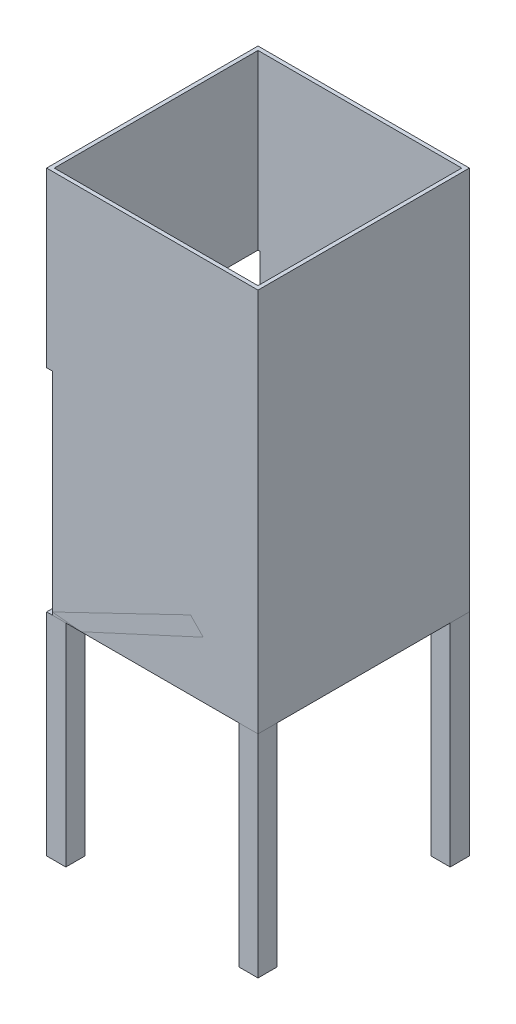
ISO-10303-21;
HEADER;
FILE_DESCRIPTION(('STEP AP214'),'2;1');
FILE_NAME('part.step','',(''),(''),'','','');
FILE_SCHEMA(('AUTOMOTIVE_DESIGN { 1 0 10303 214 1 1 1 1 }'));
ENDSEC;
DATA;
#1=APPLICATION_CONTEXT('core data for automotive mechanical design processes');
#2=APPLICATION_PROTOCOL_DEFINITION('international standard','automotive_design',2000,#1);
#3=PRODUCT_CONTEXT('',#1,'mechanical');
#4=PRODUCT('Part','Part','',(#3));
#5=PRODUCT_RELATED_PRODUCT_CATEGORY('part','',(#4));
#6=PRODUCT_DEFINITION_FORMATION('','',#4);
#7=PRODUCT_DEFINITION_CONTEXT('part definition',#1,'design');
#8=PRODUCT_DEFINITION('design','',#6,#7);
#9=PRODUCT_DEFINITION_SHAPE('','',#8);
#10=(LENGTH_UNIT() NAMED_UNIT(*) SI_UNIT(.MILLI.,.METRE.));
#11=(NAMED_UNIT(*) PLANE_ANGLE_UNIT() SI_UNIT($,.RADIAN.));
#12=(NAMED_UNIT(*) SI_UNIT($,.STERADIAN.) SOLID_ANGLE_UNIT());
#13=UNCERTAINTY_MEASURE_WITH_UNIT(LENGTH_MEASURE(1.E-05),#10,'distance_accuracy_value','');
#14=(GEOMETRIC_REPRESENTATION_CONTEXT(3) GLOBAL_UNCERTAINTY_ASSIGNED_CONTEXT((#13)) GLOBAL_UNIT_ASSIGNED_CONTEXT((#10,
#11,#12)) REPRESENTATION_CONTEXT('',''));
#15=CARTESIAN_POINT('',(0.,0.,0.));
#16=DIRECTION('',(0.,0.,1.));
#17=DIRECTION('',(1.,0.,0.));
#18=AXIS2_PLACEMENT_3D('',#15,#16,#17);
#19=CARTESIAN_POINT('',(-37.0808239238708,0.,-55.));
#20=DIRECTION('',(0.,-1.,0.));
#21=DIRECTION('',(0.,0.,-1.));
#22=AXIS2_PLACEMENT_3D('',#19,#20,#21);
#23=PLANE('',#22);
#24=DIRECTION('',(0.,0.,1.));
#25=VECTOR('',#24,1.);
#26=CARTESIAN_POINT('',(-52.,0.,-55.));
#27=LINE('',#26,#25);
#28=CARTESIAN_POINT('',(-52.,0.,-55.));
#29=VERTEX_POINT('',#28);
#30=CARTESIAN_POINT('',(-52.,0.,55.));
#31=VERTEX_POINT('',#30);
#32=EDGE_CURVE('E66',#29,#31,#27,.T.);
#33=ORIENTED_EDGE('',*,*,#32,.F.);
#34=DIRECTION('',(1.,0.,0.));
#35=VECTOR('',#34,1.);
#36=CARTESIAN_POINT('',(-37.0808239238708,0.,-55.));
#37=LINE('',#36,#35);
#38=CARTESIAN_POINT('',(-37.0808239238708,0.,-55.));
#39=VERTEX_POINT('',#38);
#40=EDGE_CURVE('E106',#29,#39,#37,.T.);
#41=ORIENTED_EDGE('',*,*,#40,.T.);
#42=DIRECTION('',(0.,0.,1.));
#43=VECTOR('',#42,1.);
#44=CARTESIAN_POINT('',(-37.0808239238708,0.,-55.));
#45=LINE('',#44,#43);
#46=CARTESIAN_POINT('',(-37.0808239238708,0.,55.));
#47=VERTEX_POINT('',#46);
#48=EDGE_CURVE('E53',#39,#47,#45,.T.);
#49=ORIENTED_EDGE('',*,*,#48,.T.);
#50=DIRECTION('',(1.,0.,0.));
#51=VECTOR('',#50,1.);
#52=CARTESIAN_POINT('',(-37.0808239238708,0.,55.));
#53=LINE('',#52,#51);
#54=EDGE_CURVE('E108',#31,#47,#53,.T.);
#55=ORIENTED_EDGE('',*,*,#54,.F.);
#56=EDGE_LOOP('',(#33,#41,#49,#55));
#57=FACE_BOUND('',#56,.T.);
#58=ADVANCED_FACE('F50',(#57),#23,.T.);
#59=CARTESIAN_POINT('',(-55.,0.,-55.));
#60=DIRECTION('',(-0.433942029879705,0.900940794227835,0.));
#61=DIRECTION('',(-0.900940794227835,-0.433942029879705,0.));
#62=AXIS2_PLACEMENT_3D('',#59,#60,#61);
#63=PLANE('',#62);
#64=DIRECTION('',(0.,0.,-1.));
#65=VECTOR('',#64,1.);
#66=CARTESIAN_POINT('',(-52.,1.44496297423724,-55.));
#67=LINE('',#66,#65);
#68=CARTESIAN_POINT('',(-52.,1.44496297423724,55.));
#69=VERTEX_POINT('',#68);
#70=CARTESIAN_POINT('',(-52.,1.44496297423724,-55.));
#71=VERTEX_POINT('',#70);
#72=EDGE_CURVE('E98',#69,#71,#67,.T.);
#73=ORIENTED_EDGE('',*,*,#72,.F.);
#74=DIRECTION('',(-0.900940794227835,-0.433942029879705,0.));
#75=VECTOR('',#74,1.);
#76=CARTESIAN_POINT('',(-55.,0.,55.));
#77=LINE('',#76,#75);
#78=CARTESIAN_POINT('',(55.,52.9819757220322,55.));
#79=VERTEX_POINT('',#78);
#80=EDGE_CURVE('E116',#79,#69,#77,.T.);
#81=ORIENTED_EDGE('',*,*,#80,.F.);
#82=DIRECTION('',(0.,0.,1.));
#83=VECTOR('',#82,1.);
#84=CARTESIAN_POINT('',(55.,52.9819757220322,-55.));
#85=LINE('',#84,#83);
#86=CARTESIAN_POINT('',(55.,52.9819757220322,-55.));
#87=VERTEX_POINT('',#86);
#88=EDGE_CURVE('E12',#87,#79,#85,.T.);
#89=ORIENTED_EDGE('',*,*,#88,.F.);
#90=DIRECTION('',(-0.900940794227835,-0.433942029879705,0.));
#91=VECTOR('',#90,1.);
#92=CARTESIAN_POINT('',(-55.,0.,-55.));
#93=LINE('',#92,#91);
#94=EDGE_CURVE('E126',#87,#71,#93,.T.);
#95=ORIENTED_EDGE('',*,*,#94,.T.);
#96=EDGE_LOOP('',(#73,#81,#89,#95));
#97=FACE_BOUND('',#96,.T.);
#98=ADVANCED_FACE('F139',(#97),#63,.T.);
#99=CARTESIAN_POINT('',(55.,52.9819757220322,-55.));
#100=DIRECTION('',(1.,0.,0.));
#101=DIRECTION('',(0.,0.,-1.));
#102=AXIS2_PLACEMENT_3D('',#99,#100,#101);
#103=PLANE('',#102);
#104=ORIENTED_EDGE('',*,*,#88,.T.);
#105=DIRECTION('',(0.,1.,0.));
#106=VECTOR('',#105,1.);
#107=CARTESIAN_POINT('',(55.,52.9819757220322,55.));
#108=LINE('',#107,#106);
#109=CARTESIAN_POINT('',(55.,42.4740583158127,55.));
#110=VERTEX_POINT('',#109);
#111=EDGE_CURVE('E121',#110,#79,#108,.T.);
#112=ORIENTED_EDGE('',*,*,#111,.F.);
#113=DIRECTION('',(0.,0.,1.));
#114=VECTOR('',#113,1.);
#115=CARTESIAN_POINT('',(55.,42.4740583158127,-55.));
#116=LINE('',#115,#114);
#117=CARTESIAN_POINT('',(55.,42.4740583158127,-55.));
#118=VERTEX_POINT('',#117);
#119=EDGE_CURVE('E58',#118,#110,#116,.T.);
#120=ORIENTED_EDGE('',*,*,#119,.F.);
#121=DIRECTION('',(0.,1.,0.));
#122=VECTOR('',#121,1.);
#123=CARTESIAN_POINT('',(55.,52.9819757220322,-55.));
#124=LINE('',#123,#122);
#125=EDGE_CURVE('E118',#118,#87,#124,.T.);
#126=ORIENTED_EDGE('',*,*,#125,.T.);
#127=EDGE_LOOP('',(#104,#112,#120,#126));
#128=FACE_BOUND('',#127,.T.);
#129=ADVANCED_FACE('F142',(#128),#103,.T.);
#130=CARTESIAN_POINT('',(55.,42.4740583158127,-55.));
#131=DIRECTION('',(0.418856684755655,-0.908052354016828,0.));
#132=DIRECTION('',(0.908052354016828,0.418856684755655,0.));
#133=AXIS2_PLACEMENT_3D('',#130,#131,#132);
#134=PLANE('',#133);
#135=ORIENTED_EDGE('',*,*,#119,.T.);
#136=DIRECTION('',(0.908052354016828,0.418856684755655,0.));
#137=VECTOR('',#136,1.);
#138=CARTESIAN_POINT('',(55.,42.4740583158127,55.));
#139=LINE('',#138,#137);
#140=EDGE_CURVE('E130',#47,#110,#139,.T.);
#141=ORIENTED_EDGE('',*,*,#140,.F.);
#142=ORIENTED_EDGE('',*,*,#48,.F.);
#143=DIRECTION('',(0.908052354016828,0.418856684755655,0.));
#144=VECTOR('',#143,1.);
#145=CARTESIAN_POINT('',(55.,42.4740583158127,-55.));
#146=LINE('',#145,#144);
#147=EDGE_CURVE('E115',#39,#118,#146,.T.);
#148=ORIENTED_EDGE('',*,*,#147,.T.);
#149=EDGE_LOOP('',(#135,#141,#142,#148));
#150=FACE_BOUND('',#149,.T.);
#151=ADVANCED_FACE('F131',(#150),#134,.T.);
#152=CARTESIAN_POINT('',(0.,0.,-55.));
#153=DIRECTION('',(0.,0.,1.));
#154=DIRECTION('',(1.,0.,0.));
#155=AXIS2_PLACEMENT_3D('',#152,#153,#154);
#156=PLANE('',#155);
#157=ORIENTED_EDGE('',*,*,#40,.F.);
#158=DIRECTION('',(0.,-1.,0.));
#159=VECTOR('',#158,1.);
#160=CARTESIAN_POINT('',(-52.,0.,-55.));
#161=LINE('',#160,#159);
#162=EDGE_CURVE('E95',#71,#29,#161,.T.);
#163=ORIENTED_EDGE('',*,*,#162,.F.);
#164=ORIENTED_EDGE('',*,*,#94,.F.);
#165=ORIENTED_EDGE('',*,*,#125,.F.);
#166=ORIENTED_EDGE('',*,*,#147,.F.);
#167=EDGE_LOOP('',(#157,#163,#164,#165,#166));
#168=FACE_BOUND('',#167,.T.);
#169=ADVANCED_FACE('F112',(#168),#156,.F.);
#170=CARTESIAN_POINT('',(0.,0.,55.));
#171=DIRECTION('',(0.,0.,1.));
#172=DIRECTION('',(1.,0.,0.));
#173=AXIS2_PLACEMENT_3D('',#170,#171,#172);
#174=PLANE('',#173);
#175=DIRECTION('',(0.,1.,0.));
#176=VECTOR('',#175,1.);
#177=CARTESIAN_POINT('',(-52.,0.,55.));
#178=LINE('',#177,#176);
#179=EDGE_CURVE('E109',#31,#69,#178,.T.);
#180=ORIENTED_EDGE('',*,*,#179,.F.);
#181=ORIENTED_EDGE('',*,*,#54,.T.);
#182=ORIENTED_EDGE('',*,*,#140,.T.);
#183=ORIENTED_EDGE('',*,*,#111,.T.);
#184=ORIENTED_EDGE('',*,*,#80,.T.);
#185=EDGE_LOOP('',(#180,#181,#182,#183,#184));
#186=FACE_BOUND('',#185,.T.);
#187=ADVANCED_FACE('F140',(#186),#174,.T.);
#188=CARTESIAN_POINT('',(-52.,0.,0.));
#189=DIRECTION('',(1.,0.,0.));
#190=DIRECTION('',(0.,0.,-1.));
#191=AXIS2_PLACEMENT_3D('',#188,#189,#190);
#192=PLANE('',#191);
#193=ORIENTED_EDGE('',*,*,#72,.T.);
#194=ORIENTED_EDGE('',*,*,#162,.T.);
#195=ORIENTED_EDGE('',*,*,#32,.T.);
#196=ORIENTED_EDGE('',*,*,#179,.T.);
#197=EDGE_LOOP('',(#193,#194,#195,#196));
#198=FACE_BOUND('',#197,.T.);
#199=ADVANCED_FACE('F96',(#198),#192,.F.);
#200=CLOSED_SHELL('',(#58,#98,#129,#151,#169,#187,#199));
#201=MANIFOLD_SOLID_BREP('B2',#200);
#202=CARTESIAN_POINT('',(-55.,-110.,-55.));
#203=DIRECTION('',(-1.,0.,0.));
#204=DIRECTION('',(0.,0.,1.));
#205=AXIS2_PLACEMENT_3D('',#202,#203,#204);
#206=PLANE('',#205);
#207=DIRECTION('',(0.,0.,1.));
#208=VECTOR('',#207,1.);
#209=CARTESIAN_POINT('',(-55.,0.,-55.));
#210=LINE('',#209,#208);
#211=CARTESIAN_POINT('',(-55.,0.,-55.));
#212=VERTEX_POINT('',#211);
#213=CARTESIAN_POINT('',(-55.,0.,-45.));
#214=VERTEX_POINT('',#213);
#215=EDGE_CURVE('E276',#212,#214,#210,.T.);
#216=ORIENTED_EDGE('',*,*,#215,.F.);
#217=DIRECTION('',(0.,1.,0.));
#218=VECTOR('',#217,1.);
#219=CARTESIAN_POINT('',(-55.,-110.,-55.));
#220=LINE('',#219,#218);
#221=CARTESIAN_POINT('',(-55.,-110.,-55.));
#222=VERTEX_POINT('',#221);
#223=EDGE_CURVE('E48',#222,#212,#220,.T.);
#224=ORIENTED_EDGE('',*,*,#223,.F.);
#225=DIRECTION('',(0.,0.,1.));
#226=VECTOR('',#225,1.);
#227=CARTESIAN_POINT('',(-55.,-110.,-55.));
#228=LINE('',#227,#226);
#229=CARTESIAN_POINT('',(-55.,-110.,-45.));
#230=VERTEX_POINT('',#229);
#231=EDGE_CURVE('E271',#222,#230,#228,.T.);
#232=ORIENTED_EDGE('',*,*,#231,.T.);
#233=DIRECTION('',(0.,1.,0.));
#234=VECTOR('',#233,1.);
#235=CARTESIAN_POINT('',(-55.,-110.,-45.));
#236=LINE('',#235,#234);
#237=EDGE_CURVE('E213',#230,#214,#236,.T.);
#238=ORIENTED_EDGE('',*,*,#237,.T.);
#239=EDGE_LOOP('',(#216,#224,#232,#238));
#240=FACE_BOUND('',#239,.T.);
#241=ADVANCED_FACE('F210',(#240),#206,.T.);
#242=CARTESIAN_POINT('',(-55.,-110.,-55.));
#243=DIRECTION('',(0.,0.,-1.));
#244=DIRECTION('',(-1.,0.,0.));
#245=AXIS2_PLACEMENT_3D('',#242,#243,#244);
#246=PLANE('',#245);
#247=DIRECTION('',(-1.,0.,0.));
#248=VECTOR('',#247,1.);
#249=CARTESIAN_POINT('',(-55.,0.,-55.));
#250=LINE('',#249,#248);
#251=CARTESIAN_POINT('',(-45.,0.,-55.));
#252=VERTEX_POINT('',#251);
#253=EDGE_CURVE('E249',#252,#212,#250,.T.);
#254=ORIENTED_EDGE('',*,*,#253,.F.);
#255=DIRECTION('',(0.,1.,0.));
#256=VECTOR('',#255,1.);
#257=CARTESIAN_POINT('',(-45.,-110.,-55.));
#258=LINE('',#257,#256);
#259=CARTESIAN_POINT('',(-45.,-110.,-55.));
#260=VERTEX_POINT('',#259);
#261=EDGE_CURVE('E219',#260,#252,#258,.T.);
#262=ORIENTED_EDGE('',*,*,#261,.F.);
#263=DIRECTION('',(-1.,0.,0.));
#264=VECTOR('',#263,1.);
#265=CARTESIAN_POINT('',(-55.,-110.,-55.));
#266=LINE('',#265,#264);
#267=EDGE_CURVE('E268',#260,#222,#266,.T.);
#268=ORIENTED_EDGE('',*,*,#267,.T.);
#269=ORIENTED_EDGE('',*,*,#223,.T.);
#270=EDGE_LOOP('',(#254,#262,#268,#269));
#271=FACE_BOUND('',#270,.T.);
#272=ADVANCED_FACE('F284',(#271),#246,.T.);
#273=CARTESIAN_POINT('',(-45.,-110.,-55.));
#274=DIRECTION('',(1.,0.,0.));
#275=DIRECTION('',(0.,0.,-1.));
#276=AXIS2_PLACEMENT_3D('',#273,#274,#275);
#277=PLANE('',#276);
#278=DIRECTION('',(0.,0.,-1.));
#279=VECTOR('',#278,1.);
#280=CARTESIAN_POINT('',(-45.,0.,-55.));
#281=LINE('',#280,#279);
#282=CARTESIAN_POINT('',(-45.,0.,-45.));
#283=VERTEX_POINT('',#282);
#284=EDGE_CURVE('E263',#283,#252,#281,.T.);
#285=ORIENTED_EDGE('',*,*,#284,.F.);
#286=DIRECTION('',(0.,1.,0.));
#287=VECTOR('',#286,1.);
#288=CARTESIAN_POINT('',(-45.,-110.,-45.));
#289=LINE('',#288,#287);
#290=CARTESIAN_POINT('',(-45.,-110.,-45.));
#291=VERTEX_POINT('',#290);
#292=EDGE_CURVE('E258',#291,#283,#289,.T.);
#293=ORIENTED_EDGE('',*,*,#292,.F.);
#294=DIRECTION('',(0.,0.,-1.));
#295=VECTOR('',#294,1.);
#296=CARTESIAN_POINT('',(-45.,-110.,-55.));
#297=LINE('',#296,#295);
#298=EDGE_CURVE('E261',#291,#260,#297,.T.);
#299=ORIENTED_EDGE('',*,*,#298,.T.);
#300=ORIENTED_EDGE('',*,*,#261,.T.);
#301=EDGE_LOOP('',(#285,#293,#299,#300));
#302=FACE_BOUND('',#301,.T.);
#303=ADVANCED_FACE('F260',(#302),#277,.T.);
#304=CARTESIAN_POINT('',(-55.,-110.,-45.));
#305=DIRECTION('',(0.,0.,1.));
#306=DIRECTION('',(1.,0.,0.));
#307=AXIS2_PLACEMENT_3D('',#304,#305,#306);
#308=PLANE('',#307);
#309=DIRECTION('',(1.,0.,0.));
#310=VECTOR('',#309,1.);
#311=CARTESIAN_POINT('',(-55.,0.,-45.));
#312=LINE('',#311,#310);
#313=EDGE_CURVE('E278',#214,#283,#312,.T.);
#314=ORIENTED_EDGE('',*,*,#313,.F.);
#315=ORIENTED_EDGE('',*,*,#237,.F.);
#316=DIRECTION('',(1.,0.,0.));
#317=VECTOR('',#316,1.);
#318=CARTESIAN_POINT('',(-55.,-110.,-45.));
#319=LINE('',#318,#317);
#320=EDGE_CURVE('E266',#230,#291,#319,.T.);
#321=ORIENTED_EDGE('',*,*,#320,.T.);
#322=ORIENTED_EDGE('',*,*,#292,.T.);
#323=EDGE_LOOP('',(#314,#315,#321,#322));
#324=FACE_BOUND('',#323,.T.);
#325=ADVANCED_FACE('F270',(#324),#308,.T.);
#326=CARTESIAN_POINT('',(0.,-110.,0.));
#327=DIRECTION('',(0.,1.,0.));
#328=DIRECTION('',(0.,0.,1.));
#329=AXIS2_PLACEMENT_3D('',#326,#327,#328);
#330=PLANE('',#329);
#331=ORIENTED_EDGE('',*,*,#231,.F.);
#332=ORIENTED_EDGE('',*,*,#267,.F.);
#333=ORIENTED_EDGE('',*,*,#298,.F.);
#334=ORIENTED_EDGE('',*,*,#320,.F.);
#335=EDGE_LOOP('',(#331,#332,#333,#334));
#336=FACE_BOUND('',#335,.T.);
#337=ADVANCED_FACE('F265',(#336),#330,.F.);
#338=CARTESIAN_POINT('',(0.,0.,0.));
#339=DIRECTION('',(0.,1.,0.));
#340=DIRECTION('',(0.,0.,1.));
#341=AXIS2_PLACEMENT_3D('',#338,#339,#340);
#342=PLANE('',#341);
#343=ORIENTED_EDGE('',*,*,#313,.T.);
#344=ORIENTED_EDGE('',*,*,#284,.T.);
#345=ORIENTED_EDGE('',*,*,#253,.T.);
#346=ORIENTED_EDGE('',*,*,#215,.T.);
#347=EDGE_LOOP('',(#343,#344,#345,#346));
#348=FACE_BOUND('',#347,.T.);
#349=ADVANCED_FACE('F282',(#348),#342,.T.);
#350=CLOSED_SHELL('',(#241,#272,#303,#325,#337,#349));
#351=MANIFOLD_SOLID_BREP('B6',#350);
#352=CARTESIAN_POINT('',(-55.,-110.,55.));
#353=DIRECTION('',(-1.,0.,0.));
#354=DIRECTION('',(0.,0.,1.));
#355=AXIS2_PLACEMENT_3D('',#352,#353,#354);
#356=PLANE('',#355);
#357=DIRECTION('',(0.,0.,1.));
#358=VECTOR('',#357,1.);
#359=CARTESIAN_POINT('',(-55.,0.,55.));
#360=LINE('',#359,#358);
#361=CARTESIAN_POINT('',(-55.,0.,45.));
#362=VERTEX_POINT('',#361);
#363=CARTESIAN_POINT('',(-55.,0.,55.));
#364=VERTEX_POINT('',#363);
#365=EDGE_CURVE('E404',#362,#364,#360,.T.);
#366=ORIENTED_EDGE('',*,*,#365,.F.);
#367=DIRECTION('',(0.,1.,0.));
#368=VECTOR('',#367,1.);
#369=CARTESIAN_POINT('',(-55.,-110.,45.));
#370=LINE('',#369,#368);
#371=CARTESIAN_POINT('',(-55.,-110.,45.));
#372=VERTEX_POINT('',#371);
#373=EDGE_CURVE('E208',#372,#362,#370,.T.);
#374=ORIENTED_EDGE('',*,*,#373,.F.);
#375=DIRECTION('',(0.,0.,1.));
#376=VECTOR('',#375,1.);
#377=CARTESIAN_POINT('',(-55.,-110.,55.));
#378=LINE('',#377,#376);
#379=CARTESIAN_POINT('',(-55.,-110.,55.));
#380=VERTEX_POINT('',#379);
#381=EDGE_CURVE('E399',#372,#380,#378,.T.);
#382=ORIENTED_EDGE('',*,*,#381,.T.);
#383=DIRECTION('',(0.,1.,0.));
#384=VECTOR('',#383,1.);
#385=CARTESIAN_POINT('',(-55.,-110.,55.));
#386=LINE('',#385,#384);
#387=EDGE_CURVE('E341',#380,#364,#386,.T.);
#388=ORIENTED_EDGE('',*,*,#387,.T.);
#389=EDGE_LOOP('',(#366,#374,#382,#388));
#390=FACE_BOUND('',#389,.T.);
#391=ADVANCED_FACE('F338',(#390),#356,.T.);
#392=CARTESIAN_POINT('',(-55.,-110.,45.));
#393=DIRECTION('',(0.,0.,-1.));
#394=DIRECTION('',(-1.,0.,0.));
#395=AXIS2_PLACEMENT_3D('',#392,#393,#394);
#396=PLANE('',#395);
#397=DIRECTION('',(-1.,0.,0.));
#398=VECTOR('',#397,1.);
#399=CARTESIAN_POINT('',(-55.,0.,45.));
#400=LINE('',#399,#398);
#401=CARTESIAN_POINT('',(-45.,0.,45.));
#402=VERTEX_POINT('',#401);
#403=EDGE_CURVE('E377',#402,#362,#400,.T.);
#404=ORIENTED_EDGE('',*,*,#403,.F.);
#405=DIRECTION('',(0.,1.,0.));
#406=VECTOR('',#405,1.);
#407=CARTESIAN_POINT('',(-45.,-110.,45.));
#408=LINE('',#407,#406);
#409=CARTESIAN_POINT('',(-45.,-110.,45.));
#410=VERTEX_POINT('',#409);
#411=EDGE_CURVE('E347',#410,#402,#408,.T.);
#412=ORIENTED_EDGE('',*,*,#411,.F.);
#413=DIRECTION('',(-1.,0.,0.));
#414=VECTOR('',#413,1.);
#415=CARTESIAN_POINT('',(-55.,-110.,45.));
#416=LINE('',#415,#414);
#417=EDGE_CURVE('E396',#410,#372,#416,.T.);
#418=ORIENTED_EDGE('',*,*,#417,.T.);
#419=ORIENTED_EDGE('',*,*,#373,.T.);
#420=EDGE_LOOP('',(#404,#412,#418,#419));
#421=FACE_BOUND('',#420,.T.);
#422=ADVANCED_FACE('F412',(#421),#396,.T.);
#423=CARTESIAN_POINT('',(-45.,-110.,55.));
#424=DIRECTION('',(1.,0.,0.));
#425=DIRECTION('',(0.,0.,-1.));
#426=AXIS2_PLACEMENT_3D('',#423,#424,#425);
#427=PLANE('',#426);
#428=DIRECTION('',(0.,0.,-1.));
#429=VECTOR('',#428,1.);
#430=CARTESIAN_POINT('',(-45.,0.,55.));
#431=LINE('',#430,#429);
#432=CARTESIAN_POINT('',(-45.,0.,55.));
#433=VERTEX_POINT('',#432);
#434=EDGE_CURVE('E391',#433,#402,#431,.T.);
#435=ORIENTED_EDGE('',*,*,#434,.F.);
#436=DIRECTION('',(0.,1.,0.));
#437=VECTOR('',#436,1.);
#438=CARTESIAN_POINT('',(-45.,-110.,55.));
#439=LINE('',#438,#437);
#440=CARTESIAN_POINT('',(-45.,-110.,55.));
#441=VERTEX_POINT('',#440);
#442=EDGE_CURVE('E386',#441,#433,#439,.T.);
#443=ORIENTED_EDGE('',*,*,#442,.F.);
#444=DIRECTION('',(0.,0.,-1.));
#445=VECTOR('',#444,1.);
#446=CARTESIAN_POINT('',(-45.,-110.,55.));
#447=LINE('',#446,#445);
#448=EDGE_CURVE('E389',#441,#410,#447,.T.);
#449=ORIENTED_EDGE('',*,*,#448,.T.);
#450=ORIENTED_EDGE('',*,*,#411,.T.);
#451=EDGE_LOOP('',(#435,#443,#449,#450));
#452=FACE_BOUND('',#451,.T.);
#453=ADVANCED_FACE('F388',(#452),#427,.T.);
#454=CARTESIAN_POINT('',(-55.,-110.,55.));
#455=DIRECTION('',(0.,0.,1.));
#456=DIRECTION('',(1.,0.,0.));
#457=AXIS2_PLACEMENT_3D('',#454,#455,#456);
#458=PLANE('',#457);
#459=DIRECTION('',(1.,0.,0.));
#460=VECTOR('',#459,1.);
#461=CARTESIAN_POINT('',(-55.,0.,55.));
#462=LINE('',#461,#460);
#463=EDGE_CURVE('E406',#364,#433,#462,.T.);
#464=ORIENTED_EDGE('',*,*,#463,.F.);
#465=ORIENTED_EDGE('',*,*,#387,.F.);
#466=DIRECTION('',(1.,0.,0.));
#467=VECTOR('',#466,1.);
#468=CARTESIAN_POINT('',(-55.,-110.,55.));
#469=LINE('',#468,#467);
#470=EDGE_CURVE('E394',#380,#441,#469,.T.);
#471=ORIENTED_EDGE('',*,*,#470,.T.);
#472=ORIENTED_EDGE('',*,*,#442,.T.);
#473=EDGE_LOOP('',(#464,#465,#471,#472));
#474=FACE_BOUND('',#473,.T.);
#475=ADVANCED_FACE('F398',(#474),#458,.T.);
#476=CARTESIAN_POINT('',(0.,-110.,0.));
#477=DIRECTION('',(0.,-1.,0.));
#478=DIRECTION('',(0.,0.,-1.));
#479=AXIS2_PLACEMENT_3D('',#476,#477,#478);
#480=PLANE('',#479);
#481=ORIENTED_EDGE('',*,*,#381,.F.);
#482=ORIENTED_EDGE('',*,*,#417,.F.);
#483=ORIENTED_EDGE('',*,*,#448,.F.);
#484=ORIENTED_EDGE('',*,*,#470,.F.);
#485=EDGE_LOOP('',(#481,#482,#483,#484));
#486=FACE_BOUND('',#485,.T.);
#487=ADVANCED_FACE('F393',(#486),#480,.T.);
#488=CARTESIAN_POINT('',(0.,0.,0.));
#489=DIRECTION('',(0.,-1.,0.));
#490=DIRECTION('',(0.,0.,-1.));
#491=AXIS2_PLACEMENT_3D('',#488,#489,#490);
#492=PLANE('',#491);
#493=ORIENTED_EDGE('',*,*,#403,.T.);
#494=ORIENTED_EDGE('',*,*,#365,.T.);
#495=ORIENTED_EDGE('',*,*,#463,.T.);
#496=ORIENTED_EDGE('',*,*,#434,.T.);
#497=EDGE_LOOP('',(#493,#494,#495,#496));
#498=FACE_BOUND('',#497,.T.);
#499=ADVANCED_FACE('F410',(#498),#492,.F.);
#500=CLOSED_SHELL('',(#391,#422,#453,#475,#487,#499));
#501=MANIFOLD_SOLID_BREP('B42',#500);
#502=CARTESIAN_POINT('',(55.,-110.,-55.));
#503=DIRECTION('',(1.,0.,0.));
#504=DIRECTION('',(0.,0.,-1.));
#505=AXIS2_PLACEMENT_3D('',#502,#503,#504);
#506=PLANE('',#505);
#507=DIRECTION('',(0.,0.,-1.));
#508=VECTOR('',#507,1.);
#509=CARTESIAN_POINT('',(55.,0.,-55.));
#510=LINE('',#509,#508);
#511=CARTESIAN_POINT('',(55.,0.,-45.));
#512=VERTEX_POINT('',#511);
#513=CARTESIAN_POINT('',(55.,0.,-55.));
#514=VERTEX_POINT('',#513);
#515=EDGE_CURVE('E530',#512,#514,#510,.T.);
#516=ORIENTED_EDGE('',*,*,#515,.F.);
#517=DIRECTION('',(0.,1.,0.));
#518=VECTOR('',#517,1.);
#519=CARTESIAN_POINT('',(55.,-110.,-45.));
#520=LINE('',#519,#518);
#521=CARTESIAN_POINT('',(55.,-110.,-45.));
#522=VERTEX_POINT('',#521);
#523=EDGE_CURVE('E336',#522,#512,#520,.T.);
#524=ORIENTED_EDGE('',*,*,#523,.F.);
#525=DIRECTION('',(0.,0.,-1.));
#526=VECTOR('',#525,1.);
#527=CARTESIAN_POINT('',(55.,-110.,-55.));
#528=LINE('',#527,#526);
#529=CARTESIAN_POINT('',(55.,-110.,-55.));
#530=VERTEX_POINT('',#529);
#531=EDGE_CURVE('E524',#522,#530,#528,.T.);
#532=ORIENTED_EDGE('',*,*,#531,.T.);
#533=DIRECTION('',(0.,1.,0.));
#534=VECTOR('',#533,1.);
#535=CARTESIAN_POINT('',(55.,-110.,-55.));
#536=LINE('',#535,#534);
#537=EDGE_CURVE('E469',#530,#514,#536,.T.);
#538=ORIENTED_EDGE('',*,*,#537,.T.);
#539=EDGE_LOOP('',(#516,#524,#532,#538));
#540=FACE_BOUND('',#539,.T.);
#541=ADVANCED_FACE('F466',(#540),#506,.T.);
#542=CARTESIAN_POINT('',(55.,-110.,-45.));
#543=DIRECTION('',(0.,0.,1.));
#544=DIRECTION('',(1.,0.,0.));
#545=AXIS2_PLACEMENT_3D('',#542,#543,#544);
#546=PLANE('',#545);
#547=DIRECTION('',(1.,0.,0.));
#548=VECTOR('',#547,1.);
#549=CARTESIAN_POINT('',(55.,0.,-45.));
#550=LINE('',#549,#548);
#551=CARTESIAN_POINT('',(45.,0.,-45.));
#552=VERTEX_POINT('',#551);
#553=EDGE_CURVE('E526',#552,#512,#550,.T.);
#554=ORIENTED_EDGE('',*,*,#553,.F.);
#555=DIRECTION('',(0.,1.,0.));
#556=VECTOR('',#555,1.);
#557=CARTESIAN_POINT('',(45.,-110.,-45.));
#558=LINE('',#557,#556);
#559=CARTESIAN_POINT('',(45.,-110.,-45.));
#560=VERTEX_POINT('',#559);
#561=EDGE_CURVE('E475',#560,#552,#558,.T.);
#562=ORIENTED_EDGE('',*,*,#561,.F.);
#563=DIRECTION('',(1.,0.,0.));
#564=VECTOR('',#563,1.);
#565=CARTESIAN_POINT('',(55.,-110.,-45.));
#566=LINE('',#565,#564);
#567=EDGE_CURVE('E521',#560,#522,#566,.T.);
#568=ORIENTED_EDGE('',*,*,#567,.T.);
#569=ORIENTED_EDGE('',*,*,#523,.T.);
#570=EDGE_LOOP('',(#554,#562,#568,#569));
#571=FACE_BOUND('',#570,.T.);
#572=ADVANCED_FACE('F540',(#571),#546,.T.);
#573=CARTESIAN_POINT('',(45.,-110.,-55.));
#574=DIRECTION('',(-1.,0.,0.));
#575=DIRECTION('',(0.,0.,1.));
#576=AXIS2_PLACEMENT_3D('',#573,#574,#575);
#577=PLANE('',#576);
#578=DIRECTION('',(0.,0.,1.));
#579=VECTOR('',#578,1.);
#580=CARTESIAN_POINT('',(45.,0.,-55.));
#581=LINE('',#580,#579);
#582=CARTESIAN_POINT('',(45.,0.,-55.));
#583=VERTEX_POINT('',#582);
#584=EDGE_CURVE('E516',#583,#552,#581,.T.);
#585=ORIENTED_EDGE('',*,*,#584,.F.);
#586=DIRECTION('',(0.,1.,0.));
#587=VECTOR('',#586,1.);
#588=CARTESIAN_POINT('',(45.,-110.,-55.));
#589=LINE('',#588,#587);
#590=CARTESIAN_POINT('',(45.,-110.,-55.));
#591=VERTEX_POINT('',#590);
#592=EDGE_CURVE('E511',#591,#583,#589,.T.);
#593=ORIENTED_EDGE('',*,*,#592,.F.);
#594=DIRECTION('',(0.,0.,1.));
#595=VECTOR('',#594,1.);
#596=CARTESIAN_POINT('',(45.,-110.,-55.));
#597=LINE('',#596,#595);
#598=EDGE_CURVE('E514',#591,#560,#597,.T.);
#599=ORIENTED_EDGE('',*,*,#598,.T.);
#600=ORIENTED_EDGE('',*,*,#561,.T.);
#601=EDGE_LOOP('',(#585,#593,#599,#600));
#602=FACE_BOUND('',#601,.T.);
#603=ADVANCED_FACE('F513',(#602),#577,.T.);
#604=CARTESIAN_POINT('',(55.,-110.,-55.));
#605=DIRECTION('',(0.,0.,-1.));
#606=DIRECTION('',(-1.,0.,0.));
#607=AXIS2_PLACEMENT_3D('',#604,#605,#606);
#608=PLANE('',#607);
#609=DIRECTION('',(-1.,0.,0.));
#610=VECTOR('',#609,1.);
#611=CARTESIAN_POINT('',(55.,0.,-55.));
#612=LINE('',#611,#610);
#613=EDGE_CURVE('E533',#514,#583,#612,.T.);
#614=ORIENTED_EDGE('',*,*,#613,.F.);
#615=ORIENTED_EDGE('',*,*,#537,.F.);
#616=DIRECTION('',(-1.,0.,0.));
#617=VECTOR('',#616,1.);
#618=CARTESIAN_POINT('',(55.,-110.,-55.));
#619=LINE('',#618,#617);
#620=EDGE_CURVE('E520',#530,#591,#619,.T.);
#621=ORIENTED_EDGE('',*,*,#620,.T.);
#622=ORIENTED_EDGE('',*,*,#592,.T.);
#623=EDGE_LOOP('',(#614,#615,#621,#622));
#624=FACE_BOUND('',#623,.T.);
#625=ADVANCED_FACE('F523',(#624),#608,.T.);
#626=CARTESIAN_POINT('',(0.,-110.,0.));
#627=DIRECTION('',(0.,-1.,0.));
#628=DIRECTION('',(0.,0.,-1.));
#629=AXIS2_PLACEMENT_3D('',#626,#627,#628);
#630=PLANE('',#629);
#631=ORIENTED_EDGE('',*,*,#531,.F.);
#632=ORIENTED_EDGE('',*,*,#567,.F.);
#633=ORIENTED_EDGE('',*,*,#598,.F.);
#634=ORIENTED_EDGE('',*,*,#620,.F.);
#635=EDGE_LOOP('',(#631,#632,#633,#634));
#636=FACE_BOUND('',#635,.T.);
#637=ADVANCED_FACE('F519',(#636),#630,.T.);
#638=CARTESIAN_POINT('',(0.,0.,0.));
#639=DIRECTION('',(0.,-1.,0.));
#640=DIRECTION('',(0.,0.,-1.));
#641=AXIS2_PLACEMENT_3D('',#638,#639,#640);
#642=PLANE('',#641);
#643=ORIENTED_EDGE('',*,*,#515,.T.);
#644=ORIENTED_EDGE('',*,*,#613,.T.);
#645=ORIENTED_EDGE('',*,*,#584,.T.);
#646=ORIENTED_EDGE('',*,*,#553,.T.);
#647=EDGE_LOOP('',(#643,#644,#645,#646));
#648=FACE_BOUND('',#647,.T.);
#649=ADVANCED_FACE('F539',(#648),#642,.F.);
#650=CLOSED_SHELL('',(#541,#572,#603,#625,#637,#649));
#651=MANIFOLD_SOLID_BREP('B202',#650);
#652=CARTESIAN_POINT('',(55.,-110.,55.));
#653=DIRECTION('',(1.,0.,0.));
#654=DIRECTION('',(0.,0.,-1.));
#655=AXIS2_PLACEMENT_3D('',#652,#653,#654);
#656=PLANE('',#655);
#657=DIRECTION('',(0.,0.,-1.));
#658=VECTOR('',#657,1.);
#659=CARTESIAN_POINT('',(55.,0.,55.));
#660=LINE('',#659,#658);
#661=CARTESIAN_POINT('',(55.,0.,55.));
#662=VERTEX_POINT('',#661);
#663=CARTESIAN_POINT('',(55.,0.,45.));
#664=VERTEX_POINT('',#663);
#665=EDGE_CURVE('E663',#662,#664,#660,.T.);
#666=ORIENTED_EDGE('',*,*,#665,.F.);
#667=DIRECTION('',(0.,1.,0.));
#668=VECTOR('',#667,1.);
#669=CARTESIAN_POINT('',(55.,-110.,55.));
#670=LINE('',#669,#668);
#671=CARTESIAN_POINT('',(55.,-110.,55.));
#672=VERTEX_POINT('',#671);
#673=EDGE_CURVE('E464',#672,#662,#670,.T.);
#674=ORIENTED_EDGE('',*,*,#673,.F.);
#675=DIRECTION('',(0.,0.,-1.));
#676=VECTOR('',#675,1.);
#677=CARTESIAN_POINT('',(55.,-110.,55.));
#678=LINE('',#677,#676);
#679=CARTESIAN_POINT('',(55.,-110.,45.));
#680=VERTEX_POINT('',#679);
#681=EDGE_CURVE('E657',#672,#680,#678,.T.);
#682=ORIENTED_EDGE('',*,*,#681,.T.);
#683=DIRECTION('',(0.,1.,0.));
#684=VECTOR('',#683,1.);
#685=CARTESIAN_POINT('',(55.,-110.,45.));
#686=LINE('',#685,#684);
#687=EDGE_CURVE('E602',#680,#664,#686,.T.);
#688=ORIENTED_EDGE('',*,*,#687,.T.);
#689=EDGE_LOOP('',(#666,#674,#682,#688));
#690=FACE_BOUND('',#689,.T.);
#691=ADVANCED_FACE('F599',(#690),#656,.T.);
#692=CARTESIAN_POINT('',(55.,-110.,55.));
#693=DIRECTION('',(0.,0.,1.));
#694=DIRECTION('',(1.,0.,0.));
#695=AXIS2_PLACEMENT_3D('',#692,#693,#694);
#696=PLANE('',#695);
#697=DIRECTION('',(1.,0.,0.));
#698=VECTOR('',#697,1.);
#699=CARTESIAN_POINT('',(55.,0.,55.));
#700=LINE('',#699,#698);
#701=CARTESIAN_POINT('',(45.,0.,55.));
#702=VERTEX_POINT('',#701);
#703=EDGE_CURVE('E659',#702,#662,#700,.T.);
#704=ORIENTED_EDGE('',*,*,#703,.F.);
#705=DIRECTION('',(0.,1.,0.));
#706=VECTOR('',#705,1.);
#707=CARTESIAN_POINT('',(45.,-110.,55.));
#708=LINE('',#707,#706);
#709=CARTESIAN_POINT('',(45.,-110.,55.));
#710=VERTEX_POINT('',#709);
#711=EDGE_CURVE('E608',#710,#702,#708,.T.);
#712=ORIENTED_EDGE('',*,*,#711,.F.);
#713=DIRECTION('',(1.,0.,0.));
#714=VECTOR('',#713,1.);
#715=CARTESIAN_POINT('',(55.,-110.,55.));
#716=LINE('',#715,#714);
#717=EDGE_CURVE('E654',#710,#672,#716,.T.);
#718=ORIENTED_EDGE('',*,*,#717,.T.);
#719=ORIENTED_EDGE('',*,*,#673,.T.);
#720=EDGE_LOOP('',(#704,#712,#718,#719));
#721=FACE_BOUND('',#720,.T.);
#722=ADVANCED_FACE('F673',(#721),#696,.T.);
#723=CARTESIAN_POINT('',(45.,-110.,55.));
#724=DIRECTION('',(-1.,0.,0.));
#725=DIRECTION('',(0.,0.,1.));
#726=AXIS2_PLACEMENT_3D('',#723,#724,#725);
#727=PLANE('',#726);
#728=DIRECTION('',(0.,0.,1.));
#729=VECTOR('',#728,1.);
#730=CARTESIAN_POINT('',(45.,0.,55.));
#731=LINE('',#730,#729);
#732=CARTESIAN_POINT('',(45.,0.,45.));
#733=VERTEX_POINT('',#732);
#734=EDGE_CURVE('E649',#733,#702,#731,.T.);
#735=ORIENTED_EDGE('',*,*,#734,.F.);
#736=DIRECTION('',(0.,1.,0.));
#737=VECTOR('',#736,1.);
#738=CARTESIAN_POINT('',(45.,-110.,45.));
#739=LINE('',#738,#737);
#740=CARTESIAN_POINT('',(45.,-110.,45.));
#741=VERTEX_POINT('',#740);
#742=EDGE_CURVE('E644',#741,#733,#739,.T.);
#743=ORIENTED_EDGE('',*,*,#742,.F.);
#744=DIRECTION('',(0.,0.,1.));
#745=VECTOR('',#744,1.);
#746=CARTESIAN_POINT('',(45.,-110.,55.));
#747=LINE('',#746,#745);
#748=EDGE_CURVE('E647',#741,#710,#747,.T.);
#749=ORIENTED_EDGE('',*,*,#748,.T.);
#750=ORIENTED_EDGE('',*,*,#711,.T.);
#751=EDGE_LOOP('',(#735,#743,#749,#750));
#752=FACE_BOUND('',#751,.T.);
#753=ADVANCED_FACE('F646',(#752),#727,.T.);
#754=CARTESIAN_POINT('',(55.,-110.,45.));
#755=DIRECTION('',(0.,0.,-1.));
#756=DIRECTION('',(-1.,0.,0.));
#757=AXIS2_PLACEMENT_3D('',#754,#755,#756);
#758=PLANE('',#757);
#759=DIRECTION('',(-1.,0.,0.));
#760=VECTOR('',#759,1.);
#761=CARTESIAN_POINT('',(55.,0.,45.));
#762=LINE('',#761,#760);
#763=EDGE_CURVE('E666',#664,#733,#762,.T.);
#764=ORIENTED_EDGE('',*,*,#763,.F.);
#765=ORIENTED_EDGE('',*,*,#687,.F.);
#766=DIRECTION('',(-1.,0.,0.));
#767=VECTOR('',#766,1.);
#768=CARTESIAN_POINT('',(55.,-110.,45.));
#769=LINE('',#768,#767);
#770=EDGE_CURVE('E653',#680,#741,#769,.T.);
#771=ORIENTED_EDGE('',*,*,#770,.T.);
#772=ORIENTED_EDGE('',*,*,#742,.T.);
#773=EDGE_LOOP('',(#764,#765,#771,#772));
#774=FACE_BOUND('',#773,.T.);
#775=ADVANCED_FACE('F656',(#774),#758,.T.);
#776=CARTESIAN_POINT('',(0.,-110.,0.));
#777=DIRECTION('',(0.,1.,0.));
#778=DIRECTION('',(0.,0.,1.));
#779=AXIS2_PLACEMENT_3D('',#776,#777,#778);
#780=PLANE('',#779);
#781=ORIENTED_EDGE('',*,*,#681,.F.);
#782=ORIENTED_EDGE('',*,*,#717,.F.);
#783=ORIENTED_EDGE('',*,*,#748,.F.);
#784=ORIENTED_EDGE('',*,*,#770,.F.);
#785=EDGE_LOOP('',(#781,#782,#783,#784));
#786=FACE_BOUND('',#785,.T.);
#787=ADVANCED_FACE('F652',(#786),#780,.F.);
#788=CARTESIAN_POINT('',(0.,0.,0.));
#789=DIRECTION('',(0.,1.,0.));
#790=DIRECTION('',(0.,0.,1.));
#791=AXIS2_PLACEMENT_3D('',#788,#789,#790);
#792=PLANE('',#791);
#793=ORIENTED_EDGE('',*,*,#665,.T.);
#794=ORIENTED_EDGE('',*,*,#763,.T.);
#795=ORIENTED_EDGE('',*,*,#734,.T.);
#796=ORIENTED_EDGE('',*,*,#703,.T.);
#797=EDGE_LOOP('',(#793,#794,#795,#796));
#798=FACE_BOUND('',#797,.T.);
#799=ADVANCED_FACE('F672',(#798),#792,.T.);
#800=CLOSED_SHELL('',(#691,#722,#753,#775,#787,#799));
#801=MANIFOLD_SOLID_BREP('B330',#800);
#802=CARTESIAN_POINT('',(55.,200.,-55.));
#803=DIRECTION('',(-1.,0.,0.));
#804=DIRECTION('',(0.,0.,1.));
#805=AXIS2_PLACEMENT_3D('',#802,#803,#804);
#806=PLANE('',#805);
#807=DIRECTION('',(0.,0.,-1.));
#808=VECTOR('',#807,1.);
#809=CARTESIAN_POINT('',(55.,0.,-55.));
#810=LINE('',#809,#808);
#811=CARTESIAN_POINT('',(55.,0.,55.));
#812=VERTEX_POINT('',#811);
#813=CARTESIAN_POINT('',(55.,0.,-55.));
#814=VERTEX_POINT('',#813);
#815=EDGE_CURVE('E832',#812,#814,#810,.T.);
#816=ORIENTED_EDGE('',*,*,#815,.T.);
#817=DIRECTION('',(0.,-1.,0.));
#818=VECTOR('',#817,1.);
#819=CARTESIAN_POINT('',(55.,200.,-55.));
#820=LINE('',#819,#818);
#821=CARTESIAN_POINT('',(55.,200.,-55.));
#822=VERTEX_POINT('',#821);
#823=EDGE_CURVE('E856',#822,#814,#820,.T.);
#824=ORIENTED_EDGE('',*,*,#823,.F.);
#825=DIRECTION('',(0.,0.,-1.));
#826=VECTOR('',#825,1.);
#827=CARTESIAN_POINT('',(55.,200.,-55.));
#828=LINE('',#827,#826);
#829=CARTESIAN_POINT('',(55.,200.,55.));
#830=VERTEX_POINT('',#829);
#831=EDGE_CURVE('E834',#830,#822,#828,.T.);
#832=ORIENTED_EDGE('',*,*,#831,.F.);
#833=DIRECTION('',(0.,-1.,0.));
#834=VECTOR('',#833,1.);
#835=CARTESIAN_POINT('',(55.,200.,55.));
#836=LINE('',#835,#834);
#837=EDGE_CURVE('E845',#830,#812,#836,.T.);
#838=ORIENTED_EDGE('',*,*,#837,.T.);
#839=EDGE_LOOP('',(#816,#824,#832,#838));
#840=FACE_BOUND('',#839,.T.);
#841=ADVANCED_FACE('F723',(#840),#806,.F.);
#842=CARTESIAN_POINT('',(-55.,200.,-55.));
#843=DIRECTION('',(0.,0.,1.));
#844=DIRECTION('',(1.,0.,0.));
#845=AXIS2_PLACEMENT_3D('',#842,#843,#844);
#846=PLANE('',#845);
#847=DIRECTION('',(0.,-1.,0.));
#848=VECTOR('',#847,1.);
#849=CARTESIAN_POINT('',(-52.,0.,-55.));
#850=LINE('',#849,#848);
#851=CARTESIAN_POINT('',(-52.,110.,-55.));
#852=VERTEX_POINT('',#851);
#853=CARTESIAN_POINT('',(-52.,0.,-55.));
#854=VERTEX_POINT('',#853);
#855=EDGE_CURVE('E738',#852,#854,#850,.T.);
#856=ORIENTED_EDGE('',*,*,#855,.F.);
#857=DIRECTION('',(-1.,0.,0.));
#858=VECTOR('',#857,1.);
#859=CARTESIAN_POINT('',(-52.,110.,-55.));
#860=LINE('',#859,#858);
#861=CARTESIAN_POINT('',(-55.,110.,-55.));
#862=VERTEX_POINT('',#861);
#863=EDGE_CURVE('E931',#852,#862,#860,.T.);
#864=ORIENTED_EDGE('',*,*,#863,.T.);
#865=DIRECTION('',(0.,-1.,0.));
#866=VECTOR('',#865,1.);
#867=CARTESIAN_POINT('',(-55.,200.,-55.));
#868=LINE('',#867,#866);
#869=CARTESIAN_POINT('',(-55.,200.,-55.));
#870=VERTEX_POINT('',#869);
#871=EDGE_CURVE('E852',#870,#862,#868,.T.);
#872=ORIENTED_EDGE('',*,*,#871,.F.);
#873=DIRECTION('',(-1.,0.,0.));
#874=VECTOR('',#873,1.);
#875=CARTESIAN_POINT('',(-55.,200.,-55.));
#876=LINE('',#875,#874);
#877=EDGE_CURVE('E840',#822,#870,#876,.T.);
#878=ORIENTED_EDGE('',*,*,#877,.F.);
#879=ORIENTED_EDGE('',*,*,#823,.T.);
#880=DIRECTION('',(-1.,0.,0.));
#881=VECTOR('',#880,1.);
#882=CARTESIAN_POINT('',(-55.,0.,-55.));
#883=LINE('',#882,#881);
#884=EDGE_CURVE('E835',#814,#854,#883,.T.);
#885=ORIENTED_EDGE('',*,*,#884,.T.);
#886=EDGE_LOOP('',(#856,#864,#872,#878,#879,#885));
#887=FACE_BOUND('',#886,.T.);
#888=ADVANCED_FACE('F951',(#887),#846,.F.);
#889=CARTESIAN_POINT('',(-55.,200.,-55.));
#890=DIRECTION('',(1.,0.,0.));
#891=DIRECTION('',(0.,0.,-1.));
#892=AXIS2_PLACEMENT_3D('',#889,#890,#891);
#893=PLANE('',#892);
#894=ORIENTED_EDGE('',*,*,#871,.T.);
#895=DIRECTION('',(0.,0.,-1.));
#896=VECTOR('',#895,1.);
#897=CARTESIAN_POINT('',(-55.,110.,-55.));
#898=LINE('',#897,#896);
#899=CARTESIAN_POINT('',(-55.,110.,55.));
#900=VERTEX_POINT('',#899);
#901=EDGE_CURVE('E938',#900,#862,#898,.T.);
#902=ORIENTED_EDGE('',*,*,#901,.F.);
#903=DIRECTION('',(0.,-1.,0.));
#904=VECTOR('',#903,1.);
#905=CARTESIAN_POINT('',(-55.,200.,55.));
#906=LINE('',#905,#904);
#907=CARTESIAN_POINT('',(-55.,200.,55.));
#908=VERTEX_POINT('',#907);
#909=EDGE_CURVE('E848',#908,#900,#906,.T.);
#910=ORIENTED_EDGE('',*,*,#909,.F.);
#911=DIRECTION('',(0.,0.,1.));
#912=VECTOR('',#911,1.);
#913=CARTESIAN_POINT('',(-55.,200.,-55.));
#914=LINE('',#913,#912);
#915=EDGE_CURVE('E915',#870,#908,#914,.T.);
#916=ORIENTED_EDGE('',*,*,#915,.F.);
#917=EDGE_LOOP('',(#894,#902,#910,#916));
#918=FACE_BOUND('',#917,.T.);
#919=ADVANCED_FACE('F959',(#918),#893,.F.);
#920=CARTESIAN_POINT('',(-55.,200.,55.));
#921=DIRECTION('',(0.,0.,-1.));
#922=DIRECTION('',(-1.,0.,0.));
#923=AXIS2_PLACEMENT_3D('',#920,#921,#922);
#924=PLANE('',#923);
#925=ORIENTED_EDGE('',*,*,#909,.T.);
#926=DIRECTION('',(-1.,0.,0.));
#927=VECTOR('',#926,1.);
#928=CARTESIAN_POINT('',(-52.,110.,55.));
#929=LINE('',#928,#927);
#930=CARTESIAN_POINT('',(-52.,110.,55.));
#931=VERTEX_POINT('',#930);
#932=EDGE_CURVE('E825',#931,#900,#929,.T.);
#933=ORIENTED_EDGE('',*,*,#932,.F.);
#934=DIRECTION('',(0.,1.,0.));
#935=VECTOR('',#934,1.);
#936=CARTESIAN_POINT('',(-52.,0.,55.));
#937=LINE('',#936,#935);
#938=CARTESIAN_POINT('',(-52.,0.,55.));
#939=VERTEX_POINT('',#938);
#940=EDGE_CURVE('E811',#939,#931,#937,.T.);
#941=ORIENTED_EDGE('',*,*,#940,.F.);
#942=DIRECTION('',(1.,0.,0.));
#943=VECTOR('',#942,1.);
#944=CARTESIAN_POINT('',(-55.,0.,55.));
#945=LINE('',#944,#943);
#946=EDGE_CURVE('E823',#939,#812,#945,.T.);
#947=ORIENTED_EDGE('',*,*,#946,.T.);
#948=ORIENTED_EDGE('',*,*,#837,.F.);
#949=DIRECTION('',(1.,0.,0.));
#950=VECTOR('',#949,1.);
#951=CARTESIAN_POINT('',(-55.,200.,55.));
#952=LINE('',#951,#950);
#953=EDGE_CURVE('E849',#908,#830,#952,.T.);
#954=ORIENTED_EDGE('',*,*,#953,.F.);
#955=EDGE_LOOP('',(#925,#933,#941,#947,#948,#954));
#956=FACE_BOUND('',#955,.T.);
#957=ADVANCED_FACE('F821',(#956),#924,.F.);
#958=CARTESIAN_POINT('',(0.,200.,0.));
#959=DIRECTION('',(0.,1.,0.));
#960=DIRECTION('',(0.,0.,1.));
#961=AXIS2_PLACEMENT_3D('',#958,#959,#960);
#962=PLANE('',#961);
#963=DIRECTION('',(0.,0.,-1.));
#964=VECTOR('',#963,1.);
#965=CARTESIAN_POINT('',(53.,200.,-55.));
#966=LINE('',#965,#964);
#967=CARTESIAN_POINT('',(53.,200.,53.));
#968=VERTEX_POINT('',#967);
#969=CARTESIAN_POINT('',(53.,200.,-53.));
#970=VERTEX_POINT('',#969);
#971=EDGE_CURVE('E886',#968,#970,#966,.T.);
#972=ORIENTED_EDGE('',*,*,#971,.F.);
#973=DIRECTION('',(1.,0.,0.));
#974=VECTOR('',#973,1.);
#975=CARTESIAN_POINT('',(-55.,200.,53.));
#976=LINE('',#975,#974);
#977=CARTESIAN_POINT('',(-53.,200.,53.));
#978=VERTEX_POINT('',#977);
#979=EDGE_CURVE('E910',#978,#968,#976,.T.);
#980=ORIENTED_EDGE('',*,*,#979,.F.);
#981=DIRECTION('',(0.,0.,1.));
#982=VECTOR('',#981,1.);
#983=CARTESIAN_POINT('',(-53.,200.,-55.));
#984=LINE('',#983,#982);
#985=CARTESIAN_POINT('',(-53.,200.,-53.));
#986=VERTEX_POINT('',#985);
#987=EDGE_CURVE('E906',#986,#978,#984,.T.);
#988=ORIENTED_EDGE('',*,*,#987,.F.);
#989=DIRECTION('',(-1.,0.,0.));
#990=VECTOR('',#989,1.);
#991=CARTESIAN_POINT('',(-55.,200.,-53.));
#992=LINE('',#991,#990);
#993=EDGE_CURVE('E903',#970,#986,#992,.T.);
#994=ORIENTED_EDGE('',*,*,#993,.F.);
#995=EDGE_LOOP('',(#972,#980,#988,#994));
#996=FACE_BOUND('',#995,.T.);
#997=ORIENTED_EDGE('',*,*,#831,.T.);
#998=ORIENTED_EDGE('',*,*,#877,.T.);
#999=ORIENTED_EDGE('',*,*,#915,.T.);
#1000=ORIENTED_EDGE('',*,*,#953,.T.);
#1001=EDGE_LOOP('',(#997,#998,#999,#1000));
#1002=FACE_BOUND('',#1001,.T.);
#1003=ADVANCED_FACE('F954',(#996,#1002),#962,.T.);
#1004=CARTESIAN_POINT('',(0.,0.,0.));
#1005=DIRECTION('',(0.,1.,0.));
#1006=DIRECTION('',(0.,0.,1.));
#1007=AXIS2_PLACEMENT_3D('',#1004,#1005,#1006);
#1008=PLANE('',#1007);
#1009=ORIENTED_EDGE('',*,*,#946,.F.);
#1010=DIRECTION('',(0.,0.,1.));
#1011=VECTOR('',#1010,1.);
#1012=CARTESIAN_POINT('',(-52.,0.,-55.));
#1013=LINE('',#1012,#1011);
#1014=EDGE_CURVE('E808',#854,#939,#1013,.T.);
#1015=ORIENTED_EDGE('',*,*,#1014,.F.);
#1016=ORIENTED_EDGE('',*,*,#884,.F.);
#1017=ORIENTED_EDGE('',*,*,#815,.F.);
#1018=EDGE_LOOP('',(#1009,#1015,#1016,#1017));
#1019=FACE_BOUND('',#1018,.T.);
#1020=ADVANCED_FACE('F830',(#1019),#1008,.F.);
#1021=CARTESIAN_POINT('',(53.,200.,-55.));
#1022=DIRECTION('',(-1.,0.,0.));
#1023=DIRECTION('',(0.,0.,1.));
#1024=AXIS2_PLACEMENT_3D('',#1021,#1022,#1023);
#1025=PLANE('',#1024);
#1026=DIRECTION('',(0.,0.,-1.));
#1027=VECTOR('',#1026,1.);
#1028=CARTESIAN_POINT('',(53.,2.,-55.));
#1029=LINE('',#1028,#1027);
#1030=CARTESIAN_POINT('',(53.,2.,53.));
#1031=VERTEX_POINT('',#1030);
#1032=CARTESIAN_POINT('',(53.,2.,-53.));
#1033=VERTEX_POINT('',#1032);
#1034=EDGE_CURVE('E880',#1031,#1033,#1029,.T.);
#1035=ORIENTED_EDGE('',*,*,#1034,.F.);
#1036=DIRECTION('',(0.,-1.,0.));
#1037=VECTOR('',#1036,1.);
#1038=CARTESIAN_POINT('',(53.,200.,53.));
#1039=LINE('',#1038,#1037);
#1040=EDGE_CURVE('E891',#968,#1031,#1039,.T.);
#1041=ORIENTED_EDGE('',*,*,#1040,.F.);
#1042=ORIENTED_EDGE('',*,*,#971,.T.);
#1043=DIRECTION('',(0.,-1.,0.));
#1044=VECTOR('',#1043,1.);
#1045=CARTESIAN_POINT('',(53.,200.,-53.));
#1046=LINE('',#1045,#1044);
#1047=EDGE_CURVE('E896',#970,#1033,#1046,.T.);
#1048=ORIENTED_EDGE('',*,*,#1047,.T.);
#1049=EDGE_LOOP('',(#1035,#1041,#1042,#1048));
#1050=FACE_BOUND('',#1049,.T.);
#1051=ADVANCED_FACE('F981',(#1050),#1025,.T.);
#1052=CARTESIAN_POINT('',(-55.,200.,-53.));
#1053=DIRECTION('',(0.,0.,1.));
#1054=DIRECTION('',(1.,0.,0.));
#1055=AXIS2_PLACEMENT_3D('',#1052,#1053,#1054);
#1056=PLANE('',#1055);
#1057=DIRECTION('',(-1.,0.,0.));
#1058=VECTOR('',#1057,1.);
#1059=CARTESIAN_POINT('',(-55.,110.,-53.));
#1060=LINE('',#1059,#1058);
#1061=CARTESIAN_POINT('',(-52.,110.,-53.));
#1062=VERTEX_POINT('',#1061);
#1063=CARTESIAN_POINT('',(-53.,110.,-53.));
#1064=VERTEX_POINT('',#1063);
#1065=EDGE_CURVE('E873',#1062,#1064,#1060,.T.);
#1066=ORIENTED_EDGE('',*,*,#1065,.F.);
#1067=DIRECTION('',(0.,1.,0.));
#1068=VECTOR('',#1067,1.);
#1069=CARTESIAN_POINT('',(-52.,200.,-53.));
#1070=LINE('',#1069,#1068);
#1071=CARTESIAN_POINT('',(-52.,2.,-53.));
#1072=VERTEX_POINT('',#1071);
#1073=EDGE_CURVE('E861',#1072,#1062,#1070,.T.);
#1074=ORIENTED_EDGE('',*,*,#1073,.F.);
#1075=DIRECTION('',(-1.,0.,0.));
#1076=VECTOR('',#1075,1.);
#1077=CARTESIAN_POINT('',(-55.,2.,-53.));
#1078=LINE('',#1077,#1076);
#1079=EDGE_CURVE('E870',#1033,#1072,#1078,.T.);
#1080=ORIENTED_EDGE('',*,*,#1079,.F.);
#1081=ORIENTED_EDGE('',*,*,#1047,.F.);
#1082=ORIENTED_EDGE('',*,*,#993,.T.);
#1083=DIRECTION('',(0.,-1.,0.));
#1084=VECTOR('',#1083,1.);
#1085=CARTESIAN_POINT('',(-53.,200.,-53.));
#1086=LINE('',#1085,#1084);
#1087=EDGE_CURVE('E893',#986,#1064,#1086,.T.);
#1088=ORIENTED_EDGE('',*,*,#1087,.T.);
#1089=EDGE_LOOP('',(#1066,#1074,#1080,#1081,#1082,#1088));
#1090=FACE_BOUND('',#1089,.T.);
#1091=ADVANCED_FACE('F868',(#1090),#1056,.T.);
#1092=CARTESIAN_POINT('',(-53.,200.,-55.));
#1093=DIRECTION('',(1.,0.,0.));
#1094=DIRECTION('',(0.,0.,-1.));
#1095=AXIS2_PLACEMENT_3D('',#1092,#1093,#1094);
#1096=PLANE('',#1095);
#1097=DIRECTION('',(0.,0.,1.));
#1098=VECTOR('',#1097,1.);
#1099=CARTESIAN_POINT('',(-53.,110.,-55.));
#1100=LINE('',#1099,#1098);
#1101=CARTESIAN_POINT('',(-53.,110.,53.));
#1102=VERTEX_POINT('',#1101);
#1103=EDGE_CURVE('E875',#1064,#1102,#1100,.T.);
#1104=ORIENTED_EDGE('',*,*,#1103,.F.);
#1105=ORIENTED_EDGE('',*,*,#1087,.F.);
#1106=ORIENTED_EDGE('',*,*,#987,.T.);
#1107=DIRECTION('',(0.,-1.,0.));
#1108=VECTOR('',#1107,1.);
#1109=CARTESIAN_POINT('',(-53.,200.,53.));
#1110=LINE('',#1109,#1108);
#1111=EDGE_CURVE('E897',#978,#1102,#1110,.T.);
#1112=ORIENTED_EDGE('',*,*,#1111,.T.);
#1113=EDGE_LOOP('',(#1104,#1105,#1106,#1112));
#1114=FACE_BOUND('',#1113,.T.);
#1115=ADVANCED_FACE('F1009',(#1114),#1096,.T.);
#1116=CARTESIAN_POINT('',(-55.,200.,53.));
#1117=DIRECTION('',(0.,0.,-1.));
#1118=DIRECTION('',(-1.,0.,0.));
#1119=AXIS2_PLACEMENT_3D('',#1116,#1117,#1118);
#1120=PLANE('',#1119);
#1121=DIRECTION('',(1.,0.,0.));
#1122=VECTOR('',#1121,1.);
#1123=CARTESIAN_POINT('',(-55.,110.,53.));
#1124=LINE('',#1123,#1122);
#1125=CARTESIAN_POINT('',(-52.,110.,53.));
#1126=VERTEX_POINT('',#1125);
#1127=EDGE_CURVE('E597',#1102,#1126,#1124,.T.);
#1128=ORIENTED_EDGE('',*,*,#1127,.F.);
#1129=ORIENTED_EDGE('',*,*,#1111,.F.);
#1130=ORIENTED_EDGE('',*,*,#979,.T.);
#1131=ORIENTED_EDGE('',*,*,#1040,.T.);
#1132=DIRECTION('',(1.,0.,0.));
#1133=VECTOR('',#1132,1.);
#1134=CARTESIAN_POINT('',(-55.,2.,53.));
#1135=LINE('',#1134,#1133);
#1136=CARTESIAN_POINT('',(-52.,2.,53.));
#1137=VERTEX_POINT('',#1136);
#1138=EDGE_CURVE('E882',#1137,#1031,#1135,.T.);
#1139=ORIENTED_EDGE('',*,*,#1138,.F.);
#1140=DIRECTION('',(0.,-1.,0.));
#1141=VECTOR('',#1140,1.);
#1142=CARTESIAN_POINT('',(-52.,200.,53.));
#1143=LINE('',#1142,#1141);
#1144=EDGE_CURVE('E745',#1126,#1137,#1143,.T.);
#1145=ORIENTED_EDGE('',*,*,#1144,.F.);
#1146=EDGE_LOOP('',(#1128,#1129,#1130,#1131,#1139,#1145));
#1147=FACE_BOUND('',#1146,.T.);
#1148=ADVANCED_FACE('F1018',(#1147),#1120,.T.);
#1149=CARTESIAN_POINT('',(0.,2.,0.));
#1150=DIRECTION('',(0.,1.,0.));
#1151=DIRECTION('',(0.,0.,1.));
#1152=AXIS2_PLACEMENT_3D('',#1149,#1150,#1151);
#1153=PLANE('',#1152);
#1154=DIRECTION('',(0.,0.,-1.));
#1155=VECTOR('',#1154,1.);
#1156=CARTESIAN_POINT('',(-52.,2.,0.));
#1157=LINE('',#1156,#1155);
#1158=EDGE_CURVE('E731',#1137,#1072,#1157,.T.);
#1159=ORIENTED_EDGE('',*,*,#1158,.F.);
#1160=ORIENTED_EDGE('',*,*,#1138,.T.);
#1161=ORIENTED_EDGE('',*,*,#1034,.T.);
#1162=ORIENTED_EDGE('',*,*,#1079,.T.);
#1163=EDGE_LOOP('',(#1159,#1160,#1161,#1162));
#1164=FACE_BOUND('',#1163,.T.);
#1165=ADVANCED_FACE('F878',(#1164),#1153,.T.);
#1166=CARTESIAN_POINT('',(-52.,110.,-55.));
#1167=DIRECTION('',(0.,1.,0.));
#1168=DIRECTION('',(0.,0.,1.));
#1169=AXIS2_PLACEMENT_3D('',#1166,#1167,#1168);
#1170=PLANE('',#1169);
#1171=ORIENTED_EDGE('',*,*,#1065,.T.);
#1172=ORIENTED_EDGE('',*,*,#1103,.T.);
#1173=ORIENTED_EDGE('',*,*,#1127,.T.);
#1174=DIRECTION('',(0.,0.,-1.));
#1175=VECTOR('',#1174,1.);
#1176=CARTESIAN_POINT('',(-52.,110.,-55.));
#1177=LINE('',#1176,#1175);
#1178=EDGE_CURVE('E934',#931,#1126,#1177,.T.);
#1179=ORIENTED_EDGE('',*,*,#1178,.F.);
#1180=ORIENTED_EDGE('',*,*,#932,.T.);
#1181=ORIENTED_EDGE('',*,*,#901,.T.);
#1182=ORIENTED_EDGE('',*,*,#863,.F.);
#1183=EDGE_CURVE('E827',#1062,#852,#1177,.T.);
#1184=ORIENTED_EDGE('',*,*,#1183,.F.);
#1185=EDGE_LOOP('',(#1171,#1172,#1173,#1179,#1180,#1181,#1182,#1184));
#1186=FACE_BOUND('',#1185,.T.);
#1187=ADVANCED_FACE('F947',(#1186),#1170,.F.);
#1188=CARTESIAN_POINT('',(-52.,0.,0.));
#1189=DIRECTION('',(1.,0.,0.));
#1190=DIRECTION('',(0.,0.,-1.));
#1191=AXIS2_PLACEMENT_3D('',#1188,#1189,#1190);
#1192=PLANE('',#1191);
#1193=ORIENTED_EDGE('',*,*,#1073,.T.);
#1194=ORIENTED_EDGE('',*,*,#1183,.T.);
#1195=ORIENTED_EDGE('',*,*,#855,.T.);
#1196=ORIENTED_EDGE('',*,*,#1014,.T.);
#1197=ORIENTED_EDGE('',*,*,#940,.T.);
#1198=ORIENTED_EDGE('',*,*,#1178,.T.);
#1199=ORIENTED_EDGE('',*,*,#1144,.T.);
#1200=ORIENTED_EDGE('',*,*,#1158,.T.);
#1201=EDGE_LOOP('',(#1193,#1194,#1195,#1196,#1197,#1198,#1199,#1200));
#1202=FACE_BOUND('',#1201,.T.);
#1203=ADVANCED_FACE('F810',(#1202),#1192,.F.);
#1204=CLOSED_SHELL('',(#841,#888,#919,#957,#1003,#1020,#1051,#1091,#1115,#1148,#1165,#1187,#1203));
#1205=MANIFOLD_SOLID_BREP('B458',#1204);
#1206=ADVANCED_BREP_SHAPE_REPRESENTATION('',(#18,#201,#351,#501,#651,#801,#1205),#14);
#1207=SHAPE_DEFINITION_REPRESENTATION(#9,#1206);
ENDSEC;
END-ISO-10303-21;
